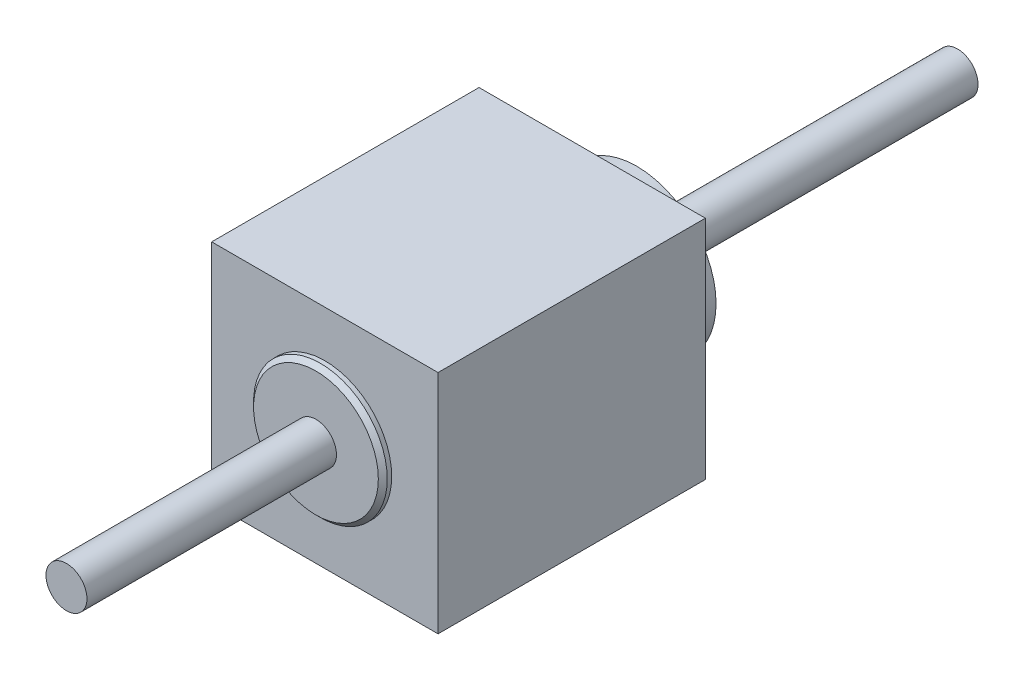
ISO-10303-21;
HEADER;
FILE_DESCRIPTION(('STEP AP214'),'2;1');
FILE_NAME('part.step','',(''),(''),'','','');
FILE_SCHEMA(('AUTOMOTIVE_DESIGN { 1 0 10303 214 1 1 1 1 }'));
ENDSEC;
DATA;
#1=APPLICATION_CONTEXT('core data for automotive mechanical design processes');
#2=APPLICATION_PROTOCOL_DEFINITION('international standard','automotive_design',2000,#1);
#3=PRODUCT_CONTEXT('',#1,'mechanical');
#4=PRODUCT('Part','Part','',(#3));
#5=PRODUCT_RELATED_PRODUCT_CATEGORY('part','',(#4));
#6=PRODUCT_DEFINITION_FORMATION('','',#4);
#7=PRODUCT_DEFINITION_CONTEXT('part definition',#1,'design');
#8=PRODUCT_DEFINITION('design','',#6,#7);
#9=PRODUCT_DEFINITION_SHAPE('','',#8);
#10=(LENGTH_UNIT() NAMED_UNIT(*) SI_UNIT(.MILLI.,.METRE.));
#11=(NAMED_UNIT(*) PLANE_ANGLE_UNIT() SI_UNIT($,.RADIAN.));
#12=(NAMED_UNIT(*) SI_UNIT($,.STERADIAN.) SOLID_ANGLE_UNIT());
#13=UNCERTAINTY_MEASURE_WITH_UNIT(LENGTH_MEASURE(1.E-05),#10,'distance_accuracy_value','');
#14=(GEOMETRIC_REPRESENTATION_CONTEXT(3) GLOBAL_UNCERTAINTY_ASSIGNED_CONTEXT((#13)) GLOBAL_UNIT_ASSIGNED_CONTEXT((#10,
#11,#12)) REPRESENTATION_CONTEXT('',''));
#15=CARTESIAN_POINT('',(0.,0.,0.));
#16=DIRECTION('',(0.,0.,1.));
#17=DIRECTION('',(1.,0.,0.));
#18=AXIS2_PLACEMENT_3D('',#15,#16,#17);
#19=CARTESIAN_POINT('',(-1.27,-1.27,3.));
#20=DIRECTION('',(1.,0.,0.));
#21=DIRECTION('',(0.,1.,0.));
#22=AXIS2_PLACEMENT_3D('',#19,#20,#21);
#23=PLANE('',#22);
#24=DIRECTION('',(0.,-1.,0.));
#25=VECTOR('',#24,1.);
#26=CARTESIAN_POINT('',(-1.27,-1.27,0.));
#27=LINE('',#26,#25);
#28=CARTESIAN_POINT('',(-1.27,1.27,0.));
#29=VERTEX_POINT('',#28);
#30=CARTESIAN_POINT('',(-1.27,-1.27,0.));
#31=VERTEX_POINT('',#30);
#32=EDGE_CURVE('E105',#29,#31,#27,.T.);
#33=ORIENTED_EDGE('',*,*,#32,.T.);
#34=DIRECTION('',(0.,0.,-1.));
#35=VECTOR('',#34,1.);
#36=CARTESIAN_POINT('',(-1.27,-1.27,3.));
#37=LINE('',#36,#35);
#38=CARTESIAN_POINT('',(-1.27,-1.27,3.));
#39=VERTEX_POINT('',#38);
#40=EDGE_CURVE('E96',#39,#31,#37,.T.);
#41=ORIENTED_EDGE('',*,*,#40,.F.);
#42=DIRECTION('',(0.,-1.,0.));
#43=VECTOR('',#42,1.);
#44=CARTESIAN_POINT('',(-1.27,-1.27,3.));
#45=LINE('',#44,#43);
#46=CARTESIAN_POINT('',(-1.27,1.27,3.));
#47=VERTEX_POINT('',#46);
#48=EDGE_CURVE('E90',#47,#39,#45,.T.);
#49=ORIENTED_EDGE('',*,*,#48,.F.);
#50=DIRECTION('',(0.,0.,-1.));
#51=VECTOR('',#50,1.);
#52=CARTESIAN_POINT('',(-1.27,1.27,3.));
#53=LINE('',#52,#51);
#54=EDGE_CURVE('E101',#47,#29,#53,.T.);
#55=ORIENTED_EDGE('',*,*,#54,.T.);
#56=EDGE_LOOP('',(#33,#41,#49,#55));
#57=FACE_BOUND('',#56,.T.);
#58=ADVANCED_FACE('F36',(#57),#23,.F.);
#59=CARTESIAN_POINT('',(1.27,-1.27,3.));
#60=DIRECTION('',(0.,1.,0.));
#61=DIRECTION('',(-1.,0.,0.));
#62=AXIS2_PLACEMENT_3D('',#59,#60,#61);
#63=PLANE('',#62);
#64=DIRECTION('',(1.,0.,0.));
#65=VECTOR('',#64,1.);
#66=CARTESIAN_POINT('',(1.27,-1.27,0.));
#67=LINE('',#66,#65);
#68=CARTESIAN_POINT('',(1.27,-1.27,0.));
#69=VERTEX_POINT('',#68);
#70=EDGE_CURVE('E95',#31,#69,#67,.T.);
#71=ORIENTED_EDGE('',*,*,#70,.T.);
#72=DIRECTION('',(0.,0.,-1.));
#73=VECTOR('',#72,1.);
#74=CARTESIAN_POINT('',(1.27,-1.27,3.));
#75=LINE('',#74,#73);
#76=CARTESIAN_POINT('',(1.27,-1.27,3.));
#77=VERTEX_POINT('',#76);
#78=EDGE_CURVE('E93',#77,#69,#75,.T.);
#79=ORIENTED_EDGE('',*,*,#78,.F.);
#80=DIRECTION('',(1.,0.,0.));
#81=VECTOR('',#80,1.);
#82=CARTESIAN_POINT('',(1.27,-1.27,3.));
#83=LINE('',#82,#81);
#84=EDGE_CURVE('E85',#39,#77,#83,.T.);
#85=ORIENTED_EDGE('',*,*,#84,.F.);
#86=ORIENTED_EDGE('',*,*,#40,.T.);
#87=EDGE_LOOP('',(#71,#79,#85,#86));
#88=FACE_BOUND('',#87,.T.);
#89=ADVANCED_FACE('F94',(#88),#63,.F.);
#90=CARTESIAN_POINT('',(1.27,-1.27,3.));
#91=DIRECTION('',(-1.,0.,0.));
#92=DIRECTION('',(0.,0.,1.));
#93=AXIS2_PLACEMENT_3D('',#90,#91,#92);
#94=PLANE('',#93);
#95=DIRECTION('',(0.,1.,0.));
#96=VECTOR('',#95,1.);
#97=CARTESIAN_POINT('',(1.27,-1.27,0.));
#98=LINE('',#97,#96);
#99=CARTESIAN_POINT('',(1.27,1.27,0.));
#100=VERTEX_POINT('',#99);
#101=EDGE_CURVE('E71',#69,#100,#98,.T.);
#102=ORIENTED_EDGE('',*,*,#101,.T.);
#103=DIRECTION('',(0.,0.,-1.));
#104=VECTOR('',#103,1.);
#105=CARTESIAN_POINT('',(1.27,1.27,3.));
#106=LINE('',#105,#104);
#107=CARTESIAN_POINT('',(1.27,1.27,3.));
#108=VERTEX_POINT('',#107);
#109=EDGE_CURVE('E97',#108,#100,#106,.T.);
#110=ORIENTED_EDGE('',*,*,#109,.F.);
#111=DIRECTION('',(0.,1.,0.));
#112=VECTOR('',#111,1.);
#113=CARTESIAN_POINT('',(1.27,-1.27,3.));
#114=LINE('',#113,#112);
#115=EDGE_CURVE('E88',#77,#108,#114,.T.);
#116=ORIENTED_EDGE('',*,*,#115,.F.);
#117=ORIENTED_EDGE('',*,*,#78,.T.);
#118=EDGE_LOOP('',(#102,#110,#116,#117));
#119=FACE_BOUND('',#118,.T.);
#120=ADVANCED_FACE('F99',(#119),#94,.F.);
#121=CARTESIAN_POINT('',(1.27,1.27,3.));
#122=DIRECTION('',(0.,-1.,0.));
#123=DIRECTION('',(0.,0.,-1.));
#124=AXIS2_PLACEMENT_3D('',#121,#122,#123);
#125=PLANE('',#124);
#126=DIRECTION('',(-1.,0.,0.));
#127=VECTOR('',#126,1.);
#128=CARTESIAN_POINT('',(1.27,1.27,0.));
#129=LINE('',#128,#127);
#130=EDGE_CURVE('E77',#100,#29,#129,.T.);
#131=ORIENTED_EDGE('',*,*,#130,.T.);
#132=ORIENTED_EDGE('',*,*,#54,.F.);
#133=DIRECTION('',(-1.,0.,0.));
#134=VECTOR('',#133,1.);
#135=CARTESIAN_POINT('',(1.27,1.27,3.));
#136=LINE('',#135,#134);
#137=EDGE_CURVE('E54',#108,#47,#136,.T.);
#138=ORIENTED_EDGE('',*,*,#137,.F.);
#139=ORIENTED_EDGE('',*,*,#109,.T.);
#140=EDGE_LOOP('',(#131,#132,#138,#139));
#141=FACE_BOUND('',#140,.T.);
#142=ADVANCED_FACE('F151',(#141),#125,.F.);
#143=CARTESIAN_POINT('',(0.,0.,3.));
#144=DIRECTION('',(0.,0.,1.));
#145=DIRECTION('',(1.,0.,0.));
#146=AXIS2_PLACEMENT_3D('',#143,#144,#145);
#147=PLANE('',#146);
#148=CARTESIAN_POINT('',(0.,0.,3.));
#149=DIRECTION('',(0.,0.,1.));
#150=DIRECTION('',(1.,0.,0.));
#151=AXIS2_PLACEMENT_3D('',#148,#149,#150);
#152=CIRCLE('',#151,0.75);
#153=CARTESIAN_POINT('',(0.75,0.,3.));
#154=VERTEX_POINT('',#153);
#155=EDGE_CURVE('E125',#154,#154,#152,.T.);
#156=ORIENTED_EDGE('',*,*,#155,.F.);
#157=EDGE_LOOP('',(#156));
#158=FACE_BOUND('',#157,.T.);
#159=ORIENTED_EDGE('',*,*,#48,.T.);
#160=ORIENTED_EDGE('',*,*,#84,.T.);
#161=ORIENTED_EDGE('',*,*,#115,.T.);
#162=ORIENTED_EDGE('',*,*,#137,.T.);
#163=EDGE_LOOP('',(#159,#160,#161,#162));
#164=FACE_BOUND('',#163,.T.);
#165=ADVANCED_FACE('F86',(#158,#164),#147,.T.);
#166=CARTESIAN_POINT('',(0.,0.,0.));
#167=DIRECTION('',(0.,0.,1.));
#168=DIRECTION('',(1.,0.,0.));
#169=AXIS2_PLACEMENT_3D('',#166,#167,#168);
#170=PLANE('',#169);
#171=CARTESIAN_POINT('',(0.,0.,0.));
#172=DIRECTION('',(0.,0.,1.));
#173=DIRECTION('',(1.,0.,0.));
#174=AXIS2_PLACEMENT_3D('',#171,#172,#173);
#175=CIRCLE('',#174,0.89);
#176=CARTESIAN_POINT('',(0.89,0.,0.));
#177=VERTEX_POINT('',#176);
#178=EDGE_CURVE('E115',#177,#177,#175,.F.);
#179=ORIENTED_EDGE('',*,*,#178,.F.);
#180=EDGE_LOOP('',(#179));
#181=FACE_BOUND('',#180,.T.);
#182=ORIENTED_EDGE('',*,*,#32,.F.);
#183=ORIENTED_EDGE('',*,*,#130,.F.);
#184=ORIENTED_EDGE('',*,*,#101,.F.);
#185=ORIENTED_EDGE('',*,*,#70,.F.);
#186=EDGE_LOOP('',(#182,#183,#184,#185));
#187=FACE_BOUND('',#186,.T.);
#188=ADVANCED_FACE('F154',(#181,#187),#170,.F.);
#189=CARTESIAN_POINT('',(0.,0.,-0.5));
#190=DIRECTION('',(0.,0.,1.));
#191=DIRECTION('',(1.,0.,0.));
#192=AXIS2_PLACEMENT_3D('',#189,#190,#191);
#193=CYLINDRICAL_SURFACE('',#192,0.89);
#194=CARTESIAN_POINT('',(0.,0.,-0.5));
#195=DIRECTION('',(0.,0.,-1.));
#196=DIRECTION('',(-1.,0.,0.));
#197=AXIS2_PLACEMENT_3D('',#194,#195,#196);
#198=CIRCLE('',#197,0.89);
#199=CARTESIAN_POINT('',(-0.89,0.,-0.5));
#200=VERTEX_POINT('',#199);
#201=EDGE_CURVE('E119',#200,#200,#198,.T.);
#202=ORIENTED_EDGE('',*,*,#201,.F.);
#203=EDGE_LOOP('',(#202));
#204=FACE_BOUND('',#203,.T.);
#205=ORIENTED_EDGE('',*,*,#178,.T.);
#206=EDGE_LOOP('',(#205));
#207=FACE_BOUND('',#206,.T.);
#208=ADVANCED_FACE('F157',(#204,#207),#193,.T.);
#209=CARTESIAN_POINT('',(0.,0.,-0.5));
#210=DIRECTION('',(0.,0.,-1.));
#211=DIRECTION('',(-1.,0.,0.));
#212=AXIS2_PLACEMENT_3D('',#209,#210,#211);
#213=PLANE('',#212);
#214=CARTESIAN_POINT('',(0.,0.,-0.5));
#215=DIRECTION('',(0.,0.,-1.));
#216=DIRECTION('',(-1.,0.,0.));
#217=AXIS2_PLACEMENT_3D('',#214,#215,#216);
#218=CIRCLE('',#217,0.23);
#219=CARTESIAN_POINT('',(-0.23,0.,-0.5));
#220=VERTEX_POINT('',#219);
#221=EDGE_CURVE('E116',#220,#220,#218,.T.);
#222=ORIENTED_EDGE('',*,*,#221,.F.);
#223=EDGE_LOOP('',(#222));
#224=FACE_BOUND('',#223,.T.);
#225=ORIENTED_EDGE('',*,*,#201,.T.);
#226=EDGE_LOOP('',(#225));
#227=FACE_BOUND('',#226,.T.);
#228=ADVANCED_FACE('F170',(#224,#227),#213,.T.);
#229=CARTESIAN_POINT('',(0.,0.,-4.1));
#230=DIRECTION('',(0.,0.,-1.));
#231=DIRECTION('',(-1.,0.,0.));
#232=AXIS2_PLACEMENT_3D('',#229,#230,#231);
#233=PLANE('',#232);
#234=CARTESIAN_POINT('',(0.,0.,-4.1));
#235=DIRECTION('',(0.,0.,-1.));
#236=DIRECTION('',(-1.,0.,0.));
#237=AXIS2_PLACEMENT_3D('',#234,#235,#236);
#238=CIRCLE('',#237,0.23);
#239=CARTESIAN_POINT('',(-0.23,0.,-4.1));
#240=VERTEX_POINT('',#239);
#241=EDGE_CURVE('E108',#240,#240,#238,.T.);
#242=ORIENTED_EDGE('',*,*,#241,.T.);
#243=EDGE_LOOP('',(#242));
#244=FACE_BOUND('',#243,.T.);
#245=ADVANCED_FACE('F166',(#244),#233,.T.);
#246=CARTESIAN_POINT('',(0.,0.,-4.1));
#247=DIRECTION('',(0.,0.,1.));
#248=DIRECTION('',(1.,0.,0.));
#249=AXIS2_PLACEMENT_3D('',#246,#247,#248);
#250=CYLINDRICAL_SURFACE('',#249,0.23);
#251=ORIENTED_EDGE('',*,*,#221,.T.);
#252=EDGE_LOOP('',(#251));
#253=FACE_BOUND('',#252,.T.);
#254=ORIENTED_EDGE('',*,*,#241,.F.);
#255=EDGE_LOOP('',(#254));
#256=FACE_BOUND('',#255,.T.);
#257=ADVANCED_FACE('F162',(#253,#256),#250,.T.);
#258=CARTESIAN_POINT('',(0.,0.,3.1));
#259=DIRECTION('',(0.,0.,-1.));
#260=DIRECTION('',(-1.,0.,0.));
#261=AXIS2_PLACEMENT_3D('',#258,#259,#260);
#262=CYLINDRICAL_SURFACE('',#261,0.75);
#263=CARTESIAN_POINT('',(0.,0.,3.05));
#264=DIRECTION('',(0.,0.,1.));
#265=DIRECTION('',(1.,0.,0.));
#266=AXIS2_PLACEMENT_3D('',#263,#264,#265);
#267=CIRCLE('',#266,0.75);
#268=CARTESIAN_POINT('',(0.75,0.,3.05));
#269=VERTEX_POINT('',#268);
#270=EDGE_CURVE('E11',#269,#269,#267,.F.);
#271=ORIENTED_EDGE('',*,*,#270,.T.);
#272=EDGE_LOOP('',(#271));
#273=FACE_BOUND('',#272,.T.);
#274=ORIENTED_EDGE('',*,*,#155,.T.);
#275=EDGE_LOOP('',(#274));
#276=FACE_BOUND('',#275,.T.);
#277=ADVANCED_FACE('F165',(#273,#276),#262,.T.);
#278=CARTESIAN_POINT('',(0.,0.,3.1));
#279=DIRECTION('',(0.,0.,1.));
#280=DIRECTION('',(1.,0.,0.));
#281=AXIS2_PLACEMENT_3D('',#278,#279,#280);
#282=PLANE('',#281);
#283=CARTESIAN_POINT('',(0.,0.,3.1));
#284=DIRECTION('',(0.,0.,1.));
#285=DIRECTION('',(1.,0.,0.));
#286=AXIS2_PLACEMENT_3D('',#283,#284,#285);
#287=CIRCLE('',#286,0.699999999999999);
#288=CARTESIAN_POINT('',(0.699999999999999,0.,3.1));
#289=VERTEX_POINT('',#288);
#290=EDGE_CURVE('E46',#289,#289,#287,.T.);
#291=ORIENTED_EDGE('',*,*,#290,.T.);
#292=EDGE_LOOP('',(#291));
#293=FACE_BOUND('',#292,.T.);
#294=CARTESIAN_POINT('',(0.,0.,3.1));
#295=DIRECTION('',(0.,0.,1.));
#296=DIRECTION('',(1.,0.,0.));
#297=AXIS2_PLACEMENT_3D('',#294,#295,#296);
#298=CIRCLE('',#297,0.23);
#299=CARTESIAN_POINT('',(0.23,0.,3.1));
#300=VERTEX_POINT('',#299);
#301=EDGE_CURVE('E122',#300,#300,#298,.T.);
#302=ORIENTED_EDGE('',*,*,#301,.F.);
#303=EDGE_LOOP('',(#302));
#304=FACE_BOUND('',#303,.T.);
#305=ADVANCED_FACE('F129',(#293,#304),#282,.T.);
#306=CARTESIAN_POINT('',(0.,0.,5.9));
#307=DIRECTION('',(0.,0.,1.));
#308=DIRECTION('',(1.,0.,0.));
#309=AXIS2_PLACEMENT_3D('',#306,#307,#308);
#310=PLANE('',#309);
#311=CARTESIAN_POINT('',(0.,0.,5.9));
#312=DIRECTION('',(0.,0.,1.));
#313=DIRECTION('',(1.,0.,0.));
#314=AXIS2_PLACEMENT_3D('',#311,#312,#313);
#315=CIRCLE('',#314,0.23);
#316=CARTESIAN_POINT('',(0.23,0.,5.9));
#317=VERTEX_POINT('',#316);
#318=EDGE_CURVE('E124',#317,#317,#315,.T.);
#319=ORIENTED_EDGE('',*,*,#318,.T.);
#320=EDGE_LOOP('',(#319));
#321=FACE_BOUND('',#320,.T.);
#322=ADVANCED_FACE('F138',(#321),#310,.T.);
#323=CARTESIAN_POINT('',(0.,0.,5.9));
#324=DIRECTION('',(0.,0.,-1.));
#325=DIRECTION('',(-1.,0.,0.));
#326=AXIS2_PLACEMENT_3D('',#323,#324,#325);
#327=CYLINDRICAL_SURFACE('',#326,0.23);
#328=ORIENTED_EDGE('',*,*,#301,.T.);
#329=EDGE_LOOP('',(#328));
#330=FACE_BOUND('',#329,.T.);
#331=ORIENTED_EDGE('',*,*,#318,.F.);
#332=EDGE_LOOP('',(#331));
#333=FACE_BOUND('',#332,.T.);
#334=ADVANCED_FACE('F133',(#330,#333),#327,.T.);
#335=CARTESIAN_POINT('',(0.,0.,3.1));
#336=DIRECTION('',(0.,0.,-1.));
#337=DIRECTION('',(-1.,0.,0.));
#338=AXIS2_PLACEMENT_3D('',#335,#336,#337);
#339=CONICAL_SURFACE('',#338,0.699999999999999,0.785398163397461);
#340=ORIENTED_EDGE('',*,*,#270,.F.);
#341=EDGE_LOOP('',(#340));
#342=FACE_BOUND('',#341,.T.);
#343=ORIENTED_EDGE('',*,*,#290,.F.);
#344=EDGE_LOOP('',(#343));
#345=FACE_BOUND('',#344,.T.);
#346=ADVANCED_FACE('F39',(#342,#345),#339,.T.);
#347=CLOSED_SHELL('',(#58,#89,#120,#142,#165,#188,#208,#228,#245,#257,#277,#305,#322,#334,#346));
#348=MANIFOLD_SOLID_BREP('B2',#347);
#349=ADVANCED_BREP_SHAPE_REPRESENTATION('',(#18,#348),#14);
#350=SHAPE_DEFINITION_REPRESENTATION(#9,#349);
ENDSEC;
END-ISO-10303-21;
